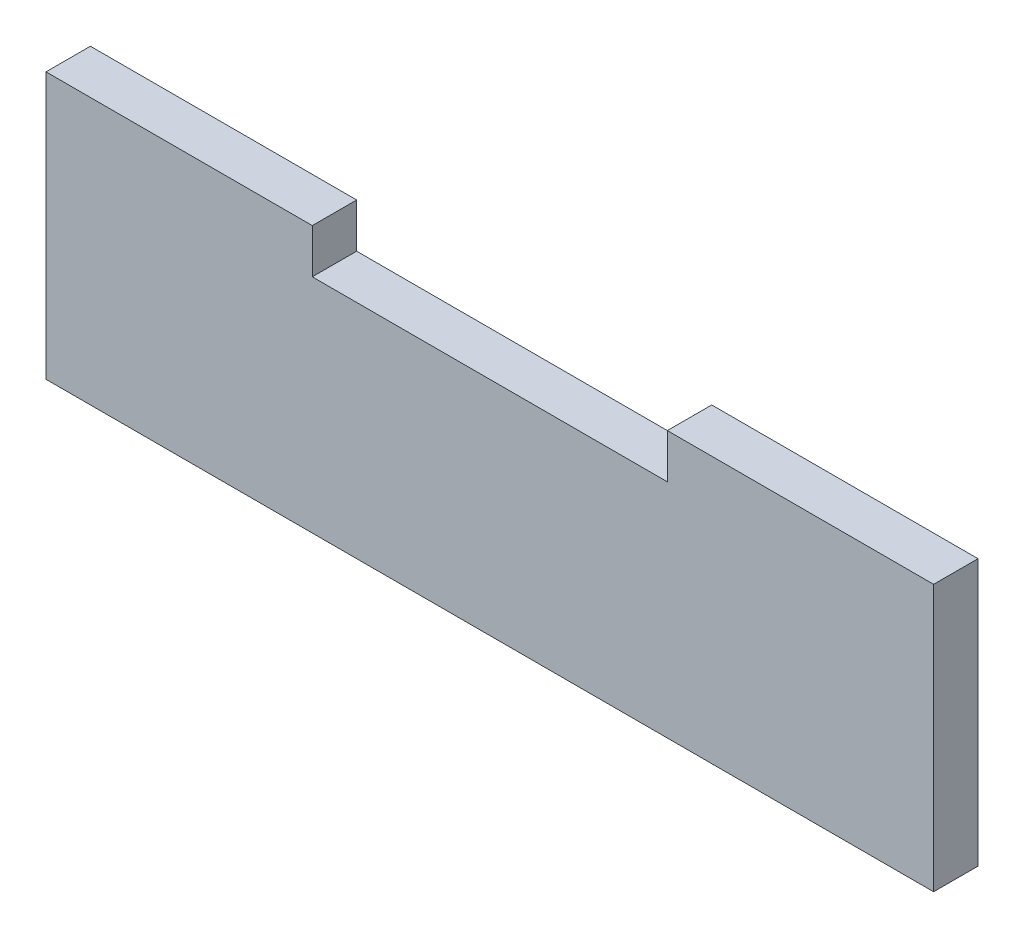
ISO-10303-21;
HEADER;
FILE_DESCRIPTION(('STEP AP214'),'2;1');
FILE_NAME('part.step','',(''),(''),'','','');
FILE_SCHEMA(('AUTOMOTIVE_DESIGN { 1 0 10303 214 1 1 1 1 }'));
ENDSEC;
DATA;
#1=APPLICATION_CONTEXT('core data for automotive mechanical design processes');
#2=APPLICATION_PROTOCOL_DEFINITION('international standard','automotive_design',2000,#1);
#3=PRODUCT_CONTEXT('',#1,'mechanical');
#4=PRODUCT('Part','Part','',(#3));
#5=PRODUCT_RELATED_PRODUCT_CATEGORY('part','',(#4));
#6=PRODUCT_DEFINITION_FORMATION('','',#4);
#7=PRODUCT_DEFINITION_CONTEXT('part definition',#1,'design');
#8=PRODUCT_DEFINITION('design','',#6,#7);
#9=PRODUCT_DEFINITION_SHAPE('','',#8);
#10=(LENGTH_UNIT() NAMED_UNIT(*) SI_UNIT(.MILLI.,.METRE.));
#11=(NAMED_UNIT(*) PLANE_ANGLE_UNIT() SI_UNIT($,.RADIAN.));
#12=(NAMED_UNIT(*) SI_UNIT($,.STERADIAN.) SOLID_ANGLE_UNIT());
#13=UNCERTAINTY_MEASURE_WITH_UNIT(LENGTH_MEASURE(1.E-05),#10,'distance_accuracy_value','');
#14=(GEOMETRIC_REPRESENTATION_CONTEXT(3) GLOBAL_UNCERTAINTY_ASSIGNED_CONTEXT((#13)) GLOBAL_UNIT_ASSIGNED_CONTEXT((#10,
#11,#12)) REPRESENTATION_CONTEXT('',''));
#15=CARTESIAN_POINT('',(0.,0.,0.));
#16=DIRECTION('',(0.,0.,1.));
#17=DIRECTION('',(1.,0.,0.));
#18=AXIS2_PLACEMENT_3D('',#15,#16,#17);
#19=CARTESIAN_POINT('',(20.,19.4723496240599,5.));
#20=DIRECTION('',(0.,-1.,0.));
#21=DIRECTION('',(1.,0.,0.));
#22=AXIS2_PLACEMENT_3D('',#19,#20,#21);
#23=PLANE('',#22);
#24=DIRECTION('',(-1.,0.,0.));
#25=VECTOR('',#24,1.);
#26=CARTESIAN_POINT('',(20.,19.4723496240599,0.));
#27=LINE('',#26,#25);
#28=CARTESIAN_POINT('',(50.,19.4723496240599,0.));
#29=VERTEX_POINT('',#28);
#30=CARTESIAN_POINT('',(20.,19.4723496240599,0.));
#31=VERTEX_POINT('',#30);
#32=EDGE_CURVE('E129',#29,#31,#27,.T.);
#33=ORIENTED_EDGE('',*,*,#32,.T.);
#34=DIRECTION('',(0.,0.,-1.));
#35=VECTOR('',#34,1.);
#36=CARTESIAN_POINT('',(20.,19.4723496240599,5.));
#37=LINE('',#36,#35);
#38=CARTESIAN_POINT('',(20.,19.4723496240599,5.));
#39=VERTEX_POINT('',#38);
#40=EDGE_CURVE('E11',#39,#31,#37,.T.);
#41=ORIENTED_EDGE('',*,*,#40,.F.);
#42=DIRECTION('',(-1.,0.,0.));
#43=VECTOR('',#42,1.);
#44=CARTESIAN_POINT('',(20.,19.4723496240599,5.));
#45=LINE('',#44,#43);
#46=CARTESIAN_POINT('',(50.,19.4723496240599,5.));
#47=VERTEX_POINT('',#46);
#48=EDGE_CURVE('E143',#47,#39,#45,.T.);
#49=ORIENTED_EDGE('',*,*,#48,.F.);
#50=DIRECTION('',(0.,0.,-1.));
#51=VECTOR('',#50,1.);
#52=CARTESIAN_POINT('',(50.,19.4723496240599,5.));
#53=LINE('',#52,#51);
#54=EDGE_CURVE('E125',#47,#29,#53,.T.);
#55=ORIENTED_EDGE('',*,*,#54,.T.);
#56=EDGE_LOOP('',(#33,#41,#49,#55));
#57=FACE_BOUND('',#56,.T.);
#58=ADVANCED_FACE('F33',(#57),#23,.F.);
#59=CARTESIAN_POINT('',(20.,14.4723496240599,5.));
#60=DIRECTION('',(1.,0.,0.));
#61=DIRECTION('',(0.,0.,-1.));
#62=AXIS2_PLACEMENT_3D('',#59,#60,#61);
#63=PLANE('',#62);
#64=DIRECTION('',(0.,-1.,0.));
#65=VECTOR('',#64,1.);
#66=CARTESIAN_POINT('',(20.,14.4723496240599,0.));
#67=LINE('',#66,#65);
#68=CARTESIAN_POINT('',(20.,14.4723496240599,0.));
#69=VERTEX_POINT('',#68);
#70=EDGE_CURVE('E132',#31,#69,#67,.T.);
#71=ORIENTED_EDGE('',*,*,#70,.T.);
#72=DIRECTION('',(0.,0.,-1.));
#73=VECTOR('',#72,1.);
#74=CARTESIAN_POINT('',(20.,14.4723496240599,5.));
#75=LINE('',#74,#73);
#76=CARTESIAN_POINT('',(20.,14.4723496240599,5.));
#77=VERTEX_POINT('',#76);
#78=EDGE_CURVE('E41',#77,#69,#75,.T.);
#79=ORIENTED_EDGE('',*,*,#78,.F.);
#80=DIRECTION('',(0.,-1.,0.));
#81=VECTOR('',#80,1.);
#82=CARTESIAN_POINT('',(20.,14.4723496240599,5.));
#83=LINE('',#82,#81);
#84=EDGE_CURVE('E92',#39,#77,#83,.T.);
#85=ORIENTED_EDGE('',*,*,#84,.F.);
#86=ORIENTED_EDGE('',*,*,#40,.T.);
#87=EDGE_LOOP('',(#71,#79,#85,#86));
#88=FACE_BOUND('',#87,.T.);
#89=ADVANCED_FACE('F178',(#88),#63,.F.);
#90=CARTESIAN_POINT('',(-20.,14.4723496240599,5.));
#91=DIRECTION('',(0.,-1.,0.));
#92=DIRECTION('',(0.,0.,-1.));
#93=AXIS2_PLACEMENT_3D('',#90,#91,#92);
#94=PLANE('',#93);
#95=DIRECTION('',(-1.,0.,0.));
#96=VECTOR('',#95,1.);
#97=CARTESIAN_POINT('',(-20.,14.4723496240599,0.));
#98=LINE('',#97,#96);
#99=CARTESIAN_POINT('',(-20.,14.4723496240599,0.));
#100=VERTEX_POINT('',#99);
#101=EDGE_CURVE('E134',#69,#100,#98,.T.);
#102=ORIENTED_EDGE('',*,*,#101,.T.);
#103=DIRECTION('',(0.,0.,-1.));
#104=VECTOR('',#103,1.);
#105=CARTESIAN_POINT('',(-20.,14.4723496240599,5.));
#106=LINE('',#105,#104);
#107=CARTESIAN_POINT('',(-20.,14.4723496240599,5.));
#108=VERTEX_POINT('',#107);
#109=EDGE_CURVE('E150',#108,#100,#106,.T.);
#110=ORIENTED_EDGE('',*,*,#109,.F.);
#111=DIRECTION('',(-1.,0.,0.));
#112=VECTOR('',#111,1.);
#113=CARTESIAN_POINT('',(-20.,14.4723496240599,5.));
#114=LINE('',#113,#112);
#115=EDGE_CURVE('E158',#77,#108,#114,.T.);
#116=ORIENTED_EDGE('',*,*,#115,.F.);
#117=ORIENTED_EDGE('',*,*,#78,.T.);
#118=EDGE_LOOP('',(#102,#110,#116,#117));
#119=FACE_BOUND('',#118,.T.);
#120=ADVANCED_FACE('F156',(#119),#94,.F.);
#121=CARTESIAN_POINT('',(-20.,19.4723496240599,5.));
#122=DIRECTION('',(-1.,0.,0.));
#123=DIRECTION('',(0.,0.,1.));
#124=AXIS2_PLACEMENT_3D('',#121,#122,#123);
#125=PLANE('',#124);
#126=DIRECTION('',(0.,1.,0.));
#127=VECTOR('',#126,1.);
#128=CARTESIAN_POINT('',(-20.,19.4723496240599,0.));
#129=LINE('',#128,#127);
#130=CARTESIAN_POINT('',(-20.,19.4723496240599,0.));
#131=VERTEX_POINT('',#130);
#132=EDGE_CURVE('E136',#100,#131,#129,.T.);
#133=ORIENTED_EDGE('',*,*,#132,.T.);
#134=DIRECTION('',(0.,0.,-1.));
#135=VECTOR('',#134,1.);
#136=CARTESIAN_POINT('',(-20.,19.4723496240599,5.));
#137=LINE('',#136,#135);
#138=CARTESIAN_POINT('',(-20.,19.4723496240599,5.));
#139=VERTEX_POINT('',#138);
#140=EDGE_CURVE('E147',#139,#131,#137,.T.);
#141=ORIENTED_EDGE('',*,*,#140,.F.);
#142=DIRECTION('',(0.,1.,0.));
#143=VECTOR('',#142,1.);
#144=CARTESIAN_POINT('',(-20.,19.4723496240599,5.));
#145=LINE('',#144,#143);
#146=EDGE_CURVE('E170',#108,#139,#145,.T.);
#147=ORIENTED_EDGE('',*,*,#146,.F.);
#148=ORIENTED_EDGE('',*,*,#109,.T.);
#149=EDGE_LOOP('',(#133,#141,#147,#148));
#150=FACE_BOUND('',#149,.T.);
#151=ADVANCED_FACE('F166',(#150),#125,.F.);
#152=CARTESIAN_POINT('',(-50.,19.4723496240599,5.));
#153=DIRECTION('',(0.,-1.,0.));
#154=DIRECTION('',(1.,0.,0.));
#155=AXIS2_PLACEMENT_3D('',#152,#153,#154);
#156=PLANE('',#155);
#157=DIRECTION('',(-1.,0.,0.));
#158=VECTOR('',#157,1.);
#159=CARTESIAN_POINT('',(-50.,19.4723496240599,0.));
#160=LINE('',#159,#158);
#161=CARTESIAN_POINT('',(-50.,19.4723496240599,0.));
#162=VERTEX_POINT('',#161);
#163=EDGE_CURVE('E138',#131,#162,#160,.T.);
#164=ORIENTED_EDGE('',*,*,#163,.T.);
#165=DIRECTION('',(0.,0.,-1.));
#166=VECTOR('',#165,1.);
#167=CARTESIAN_POINT('',(-50.,19.4723496240599,5.));
#168=LINE('',#167,#166);
#169=CARTESIAN_POINT('',(-50.,19.4723496240599,5.));
#170=VERTEX_POINT('',#169);
#171=EDGE_CURVE('E120',#170,#162,#168,.T.);
#172=ORIENTED_EDGE('',*,*,#171,.F.);
#173=DIRECTION('',(-1.,0.,0.));
#174=VECTOR('',#173,1.);
#175=CARTESIAN_POINT('',(-50.,19.4723496240599,5.));
#176=LINE('',#175,#174);
#177=EDGE_CURVE('E111',#139,#170,#176,.T.);
#178=ORIENTED_EDGE('',*,*,#177,.F.);
#179=ORIENTED_EDGE('',*,*,#140,.T.);
#180=EDGE_LOOP('',(#164,#172,#178,#179));
#181=FACE_BOUND('',#180,.T.);
#182=ADVANCED_FACE('F169',(#181),#156,.F.);
#183=CARTESIAN_POINT('',(-50.,-10.5276503759401,5.));
#184=DIRECTION('',(1.,0.,0.));
#185=DIRECTION('',(0.,0.,-1.));
#186=AXIS2_PLACEMENT_3D('',#183,#184,#185);
#187=PLANE('',#186);
#188=DIRECTION('',(0.,-1.,0.));
#189=VECTOR('',#188,1.);
#190=CARTESIAN_POINT('',(-50.,-10.5276503759401,0.));
#191=LINE('',#190,#189);
#192=CARTESIAN_POINT('',(-50.,-10.5276503759401,0.));
#193=VERTEX_POINT('',#192);
#194=EDGE_CURVE('E119',#162,#193,#191,.T.);
#195=ORIENTED_EDGE('',*,*,#194,.T.);
#196=DIRECTION('',(0.,0.,-1.));
#197=VECTOR('',#196,1.);
#198=CARTESIAN_POINT('',(-50.,-10.5276503759401,5.));
#199=LINE('',#198,#197);
#200=CARTESIAN_POINT('',(-50.,-10.5276503759401,5.));
#201=VERTEX_POINT('',#200);
#202=EDGE_CURVE('E116',#201,#193,#199,.T.);
#203=ORIENTED_EDGE('',*,*,#202,.F.);
#204=DIRECTION('',(0.,-1.,0.));
#205=VECTOR('',#204,1.);
#206=CARTESIAN_POINT('',(-50.,-10.5276503759401,5.));
#207=LINE('',#206,#205);
#208=EDGE_CURVE('E105',#170,#201,#207,.T.);
#209=ORIENTED_EDGE('',*,*,#208,.F.);
#210=ORIENTED_EDGE('',*,*,#171,.T.);
#211=EDGE_LOOP('',(#195,#203,#209,#210));
#212=FACE_BOUND('',#211,.T.);
#213=ADVANCED_FACE('F117',(#212),#187,.F.);
#214=CARTESIAN_POINT('',(-50.,-10.5276503759401,5.));
#215=DIRECTION('',(0.,1.,0.));
#216=DIRECTION('',(0.,0.,1.));
#217=AXIS2_PLACEMENT_3D('',#214,#215,#216);
#218=PLANE('',#217);
#219=DIRECTION('',(1.,0.,0.));
#220=VECTOR('',#219,1.);
#221=CARTESIAN_POINT('',(-50.,-10.5276503759401,0.));
#222=LINE('',#221,#220);
#223=CARTESIAN_POINT('',(50.,-10.5276503759401,0.));
#224=VERTEX_POINT('',#223);
#225=EDGE_CURVE('E78',#193,#224,#222,.T.);
#226=ORIENTED_EDGE('',*,*,#225,.T.);
#227=DIRECTION('',(0.,0.,-1.));
#228=VECTOR('',#227,1.);
#229=CARTESIAN_POINT('',(50.,-10.5276503759401,5.));
#230=LINE('',#229,#228);
#231=CARTESIAN_POINT('',(50.,-10.5276503759401,5.));
#232=VERTEX_POINT('',#231);
#233=EDGE_CURVE('E121',#232,#224,#230,.T.);
#234=ORIENTED_EDGE('',*,*,#233,.F.);
#235=DIRECTION('',(1.,0.,0.));
#236=VECTOR('',#235,1.);
#237=CARTESIAN_POINT('',(-50.,-10.5276503759401,5.));
#238=LINE('',#237,#236);
#239=EDGE_CURVE('E109',#201,#232,#238,.T.);
#240=ORIENTED_EDGE('',*,*,#239,.F.);
#241=ORIENTED_EDGE('',*,*,#202,.T.);
#242=EDGE_LOOP('',(#226,#234,#240,#241));
#243=FACE_BOUND('',#242,.T.);
#244=ADVANCED_FACE('F123',(#243),#218,.F.);
#245=CARTESIAN_POINT('',(50.,-10.5276503759401,5.));
#246=DIRECTION('',(-1.,0.,0.));
#247=DIRECTION('',(0.,0.,1.));
#248=AXIS2_PLACEMENT_3D('',#245,#246,#247);
#249=PLANE('',#248);
#250=DIRECTION('',(0.,1.,0.));
#251=VECTOR('',#250,1.);
#252=CARTESIAN_POINT('',(50.,-10.5276503759401,0.));
#253=LINE('',#252,#251);
#254=EDGE_CURVE('E84',#224,#29,#253,.T.);
#255=ORIENTED_EDGE('',*,*,#254,.T.);
#256=ORIENTED_EDGE('',*,*,#54,.F.);
#257=DIRECTION('',(0.,1.,0.));
#258=VECTOR('',#257,1.);
#259=CARTESIAN_POINT('',(50.,-10.5276503759401,5.));
#260=LINE('',#259,#258);
#261=EDGE_CURVE('E49',#232,#47,#260,.T.);
#262=ORIENTED_EDGE('',*,*,#261,.F.);
#263=ORIENTED_EDGE('',*,*,#233,.T.);
#264=EDGE_LOOP('',(#255,#256,#262,#263));
#265=FACE_BOUND('',#264,.T.);
#266=ADVANCED_FACE('F194',(#265),#249,.F.);
#267=CARTESIAN_POINT('',(0.,0.,5.));
#268=DIRECTION('',(0.,0.,1.));
#269=DIRECTION('',(1.,0.,0.));
#270=AXIS2_PLACEMENT_3D('',#267,#268,#269);
#271=PLANE('',#270);
#272=ORIENTED_EDGE('',*,*,#48,.T.);
#273=ORIENTED_EDGE('',*,*,#84,.T.);
#274=ORIENTED_EDGE('',*,*,#115,.T.);
#275=ORIENTED_EDGE('',*,*,#146,.T.);
#276=ORIENTED_EDGE('',*,*,#177,.T.);
#277=ORIENTED_EDGE('',*,*,#208,.T.);
#278=ORIENTED_EDGE('',*,*,#239,.T.);
#279=ORIENTED_EDGE('',*,*,#261,.T.);
#280=EDGE_LOOP('',(#272,#273,#274,#275,#276,#277,#278,#279));
#281=FACE_BOUND('',#280,.T.);
#282=ADVANCED_FACE('F107',(#281),#271,.T.);
#283=CARTESIAN_POINT('',(0.,0.,0.));
#284=DIRECTION('',(0.,0.,1.));
#285=DIRECTION('',(1.,0.,0.));
#286=AXIS2_PLACEMENT_3D('',#283,#284,#285);
#287=PLANE('',#286);
#288=ORIENTED_EDGE('',*,*,#32,.F.);
#289=ORIENTED_EDGE('',*,*,#254,.F.);
#290=ORIENTED_EDGE('',*,*,#225,.F.);
#291=ORIENTED_EDGE('',*,*,#194,.F.);
#292=ORIENTED_EDGE('',*,*,#163,.F.);
#293=ORIENTED_EDGE('',*,*,#132,.F.);
#294=ORIENTED_EDGE('',*,*,#101,.F.);
#295=ORIENTED_EDGE('',*,*,#70,.F.);
#296=EDGE_LOOP('',(#288,#289,#290,#291,#292,#293,#294,#295));
#297=FACE_BOUND('',#296,.T.);
#298=ADVANCED_FACE('F162',(#297),#287,.F.);
#299=CLOSED_SHELL('',(#58,#89,#120,#151,#182,#213,#244,#266,#282,#298));
#300=MANIFOLD_SOLID_BREP('B2',#299);
#301=ADVANCED_BREP_SHAPE_REPRESENTATION('',(#18,#300),#14);
#302=SHAPE_DEFINITION_REPRESENTATION(#9,#301);
ENDSEC;
END-ISO-10303-21;
